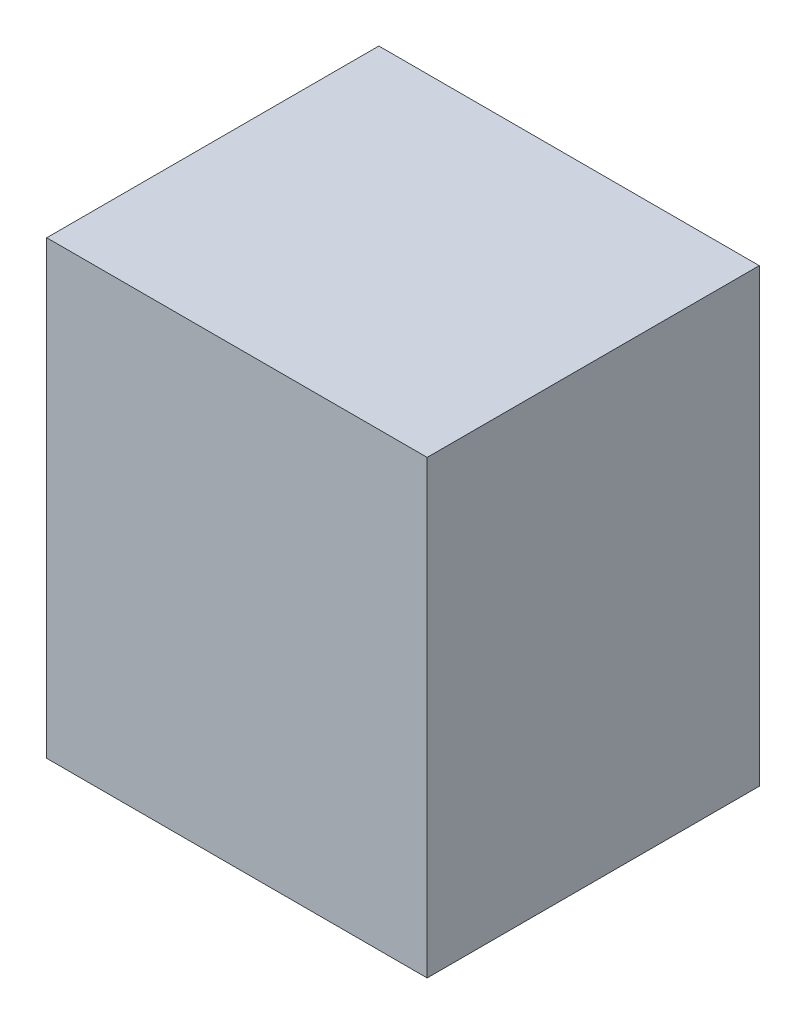
ISO-10303-21;
HEADER;
FILE_DESCRIPTION(('STEP AP214'),'2;1');
FILE_NAME('part.step','',(''),(''),'','','');
FILE_SCHEMA(('AUTOMOTIVE_DESIGN { 1 0 10303 214 1 1 1 1 }'));
ENDSEC;
DATA;
#1=APPLICATION_CONTEXT('core data for automotive mechanical design processes');
#2=APPLICATION_PROTOCOL_DEFINITION('international standard','automotive_design',2000,#1);
#3=PRODUCT_CONTEXT('',#1,'mechanical');
#4=PRODUCT('Part','Part','',(#3));
#5=PRODUCT_RELATED_PRODUCT_CATEGORY('part','',(#4));
#6=PRODUCT_DEFINITION_FORMATION('','',#4);
#7=PRODUCT_DEFINITION_CONTEXT('part definition',#1,'design');
#8=PRODUCT_DEFINITION('design','',#6,#7);
#9=PRODUCT_DEFINITION_SHAPE('','',#8);
#10=(LENGTH_UNIT() NAMED_UNIT(*) SI_UNIT(.MILLI.,.METRE.));
#11=(NAMED_UNIT(*) PLANE_ANGLE_UNIT() SI_UNIT($,.RADIAN.));
#12=(NAMED_UNIT(*) SI_UNIT($,.STERADIAN.) SOLID_ANGLE_UNIT());
#13=UNCERTAINTY_MEASURE_WITH_UNIT(LENGTH_MEASURE(1.E-05),#10,'distance_accuracy_value','');
#14=(GEOMETRIC_REPRESENTATION_CONTEXT(3) GLOBAL_UNCERTAINTY_ASSIGNED_CONTEXT((#13)) GLOBAL_UNIT_ASSIGNED_CONTEXT((#10,
#11,#12)) REPRESENTATION_CONTEXT('',''));
#15=CARTESIAN_POINT('',(0.,0.,0.));
#16=DIRECTION('',(0.,0.,1.));
#17=DIRECTION('',(1.,0.,0.));
#18=AXIS2_PLACEMENT_3D('',#15,#16,#17);
#19=CARTESIAN_POINT('',(0.,568.96,0.));
#20=DIRECTION('',(1.,0.,0.));
#21=DIRECTION('',(0.,0.,-1.));
#22=AXIS2_PLACEMENT_3D('',#19,#20,#21);
#23=PLANE('',#22);
#24=DIRECTION('',(0.,0.,1.));
#25=VECTOR('',#24,1.);
#26=CARTESIAN_POINT('',(0.,0.,0.));
#27=LINE('',#26,#25);
#28=CARTESIAN_POINT('',(0.,0.,0.));
#29=VERTEX_POINT('',#28);
#30=CARTESIAN_POINT('',(0.,0.,419.1));
#31=VERTEX_POINT('',#30);
#32=EDGE_CURVE('E96',#29,#31,#27,.T.);
#33=ORIENTED_EDGE('',*,*,#32,.T.);
#34=DIRECTION('',(0.,-1.,0.));
#35=VECTOR('',#34,1.);
#36=CARTESIAN_POINT('',(0.,568.96,419.1));
#37=LINE('',#36,#35);
#38=CARTESIAN_POINT('',(0.,568.96,419.1));
#39=VERTEX_POINT('',#38);
#40=EDGE_CURVE('E11',#39,#31,#37,.T.);
#41=ORIENTED_EDGE('',*,*,#40,.F.);
#42=DIRECTION('',(0.,0.,1.));
#43=VECTOR('',#42,1.);
#44=CARTESIAN_POINT('',(0.,568.96,0.));
#45=LINE('',#44,#43);
#46=CARTESIAN_POINT('',(0.,568.96,0.));
#47=VERTEX_POINT('',#46);
#48=EDGE_CURVE('E84',#47,#39,#45,.T.);
#49=ORIENTED_EDGE('',*,*,#48,.F.);
#50=DIRECTION('',(0.,-1.,0.));
#51=VECTOR('',#50,1.);
#52=CARTESIAN_POINT('',(0.,568.96,0.));
#53=LINE('',#52,#51);
#54=EDGE_CURVE('E92',#47,#29,#53,.T.);
#55=ORIENTED_EDGE('',*,*,#54,.T.);
#56=EDGE_LOOP('',(#33,#41,#49,#55));
#57=FACE_BOUND('',#56,.T.);
#58=ADVANCED_FACE('F33',(#57),#23,.F.);
#59=CARTESIAN_POINT('',(0.,568.96,419.1));
#60=DIRECTION('',(0.,0.,-1.));
#61=DIRECTION('',(-1.,0.,0.));
#62=AXIS2_PLACEMENT_3D('',#59,#60,#61);
#63=PLANE('',#62);
#64=DIRECTION('',(1.,0.,0.));
#65=VECTOR('',#64,1.);
#66=CARTESIAN_POINT('',(0.,0.,419.1));
#67=LINE('',#66,#65);
#68=CARTESIAN_POINT('',(480.06,0.,419.1));
#69=VERTEX_POINT('',#68);
#70=EDGE_CURVE('E88',#31,#69,#67,.T.);
#71=ORIENTED_EDGE('',*,*,#70,.T.);
#72=DIRECTION('',(0.,-1.,0.));
#73=VECTOR('',#72,1.);
#74=CARTESIAN_POINT('',(480.06,568.96,419.1));
#75=LINE('',#74,#73);
#76=CARTESIAN_POINT('',(480.06,568.96,419.1));
#77=VERTEX_POINT('',#76);
#78=EDGE_CURVE('E41',#77,#69,#75,.T.);
#79=ORIENTED_EDGE('',*,*,#78,.F.);
#80=DIRECTION('',(1.,0.,0.));
#81=VECTOR('',#80,1.);
#82=CARTESIAN_POINT('',(0.,568.96,419.1));
#83=LINE('',#82,#81);
#84=EDGE_CURVE('E79',#39,#77,#83,.T.);
#85=ORIENTED_EDGE('',*,*,#84,.F.);
#86=ORIENTED_EDGE('',*,*,#40,.T.);
#87=EDGE_LOOP('',(#71,#79,#85,#86));
#88=FACE_BOUND('',#87,.T.);
#89=ADVANCED_FACE('F87',(#88),#63,.F.);
#90=CARTESIAN_POINT('',(480.06,568.96,0.));
#91=DIRECTION('',(-1.,0.,0.));
#92=DIRECTION('',(0.,0.,1.));
#93=AXIS2_PLACEMENT_3D('',#90,#91,#92);
#94=PLANE('',#93);
#95=DIRECTION('',(0.,0.,-1.));
#96=VECTOR('',#95,1.);
#97=CARTESIAN_POINT('',(480.06,0.,0.));
#98=LINE('',#97,#96);
#99=CARTESIAN_POINT('',(480.06,0.,0.));
#100=VERTEX_POINT('',#99);
#101=EDGE_CURVE('E66',#69,#100,#98,.T.);
#102=ORIENTED_EDGE('',*,*,#101,.T.);
#103=DIRECTION('',(0.,-1.,0.));
#104=VECTOR('',#103,1.);
#105=CARTESIAN_POINT('',(480.06,568.96,0.));
#106=LINE('',#105,#104);
#107=CARTESIAN_POINT('',(480.06,568.96,0.));
#108=VERTEX_POINT('',#107);
#109=EDGE_CURVE('E89',#108,#100,#106,.T.);
#110=ORIENTED_EDGE('',*,*,#109,.F.);
#111=DIRECTION('',(0.,0.,-1.));
#112=VECTOR('',#111,1.);
#113=CARTESIAN_POINT('',(480.06,568.96,0.));
#114=LINE('',#113,#112);
#115=EDGE_CURVE('E82',#77,#108,#114,.T.);
#116=ORIENTED_EDGE('',*,*,#115,.F.);
#117=ORIENTED_EDGE('',*,*,#78,.T.);
#118=EDGE_LOOP('',(#102,#110,#116,#117));
#119=FACE_BOUND('',#118,.T.);
#120=ADVANCED_FACE('F90',(#119),#94,.F.);
#121=CARTESIAN_POINT('',(0.,568.96,0.));
#122=DIRECTION('',(0.,0.,1.));
#123=DIRECTION('',(1.,0.,0.));
#124=AXIS2_PLACEMENT_3D('',#121,#122,#123);
#125=PLANE('',#124);
#126=DIRECTION('',(-1.,0.,0.));
#127=VECTOR('',#126,1.);
#128=CARTESIAN_POINT('',(0.,0.,0.));
#129=LINE('',#128,#127);
#130=EDGE_CURVE('E72',#100,#29,#129,.T.);
#131=ORIENTED_EDGE('',*,*,#130,.T.);
#132=ORIENTED_EDGE('',*,*,#54,.F.);
#133=DIRECTION('',(-1.,0.,0.));
#134=VECTOR('',#133,1.);
#135=CARTESIAN_POINT('',(0.,568.96,0.));
#136=LINE('',#135,#134);
#137=EDGE_CURVE('E49',#108,#47,#136,.T.);
#138=ORIENTED_EDGE('',*,*,#137,.F.);
#139=ORIENTED_EDGE('',*,*,#109,.T.);
#140=EDGE_LOOP('',(#131,#132,#138,#139));
#141=FACE_BOUND('',#140,.T.);
#142=ADVANCED_FACE('F103',(#141),#125,.F.);
#143=CARTESIAN_POINT('',(0.,568.96,0.));
#144=DIRECTION('',(0.,1.,0.));
#145=DIRECTION('',(0.,0.,1.));
#146=AXIS2_PLACEMENT_3D('',#143,#144,#145);
#147=PLANE('',#146);
#148=ORIENTED_EDGE('',*,*,#48,.T.);
#149=ORIENTED_EDGE('',*,*,#84,.T.);
#150=ORIENTED_EDGE('',*,*,#115,.T.);
#151=ORIENTED_EDGE('',*,*,#137,.T.);
#152=EDGE_LOOP('',(#148,#149,#150,#151));
#153=FACE_BOUND('',#152,.T.);
#154=ADVANCED_FACE('F80',(#153),#147,.T.);
#155=CARTESIAN_POINT('',(0.,0.,0.));
#156=DIRECTION('',(0.,1.,0.));
#157=DIRECTION('',(0.,0.,1.));
#158=AXIS2_PLACEMENT_3D('',#155,#156,#157);
#159=PLANE('',#158);
#160=ORIENTED_EDGE('',*,*,#32,.F.);
#161=ORIENTED_EDGE('',*,*,#130,.F.);
#162=ORIENTED_EDGE('',*,*,#101,.F.);
#163=ORIENTED_EDGE('',*,*,#70,.F.);
#164=EDGE_LOOP('',(#160,#161,#162,#163));
#165=FACE_BOUND('',#164,.T.);
#166=ADVANCED_FACE('F106',(#165),#159,.F.);
#167=CLOSED_SHELL('',(#58,#89,#120,#142,#154,#166));
#168=MANIFOLD_SOLID_BREP('B2',#167);
#169=ADVANCED_BREP_SHAPE_REPRESENTATION('',(#18,#168),#14);
#170=SHAPE_DEFINITION_REPRESENTATION(#9,#169);
ENDSEC;
END-ISO-10303-21;
